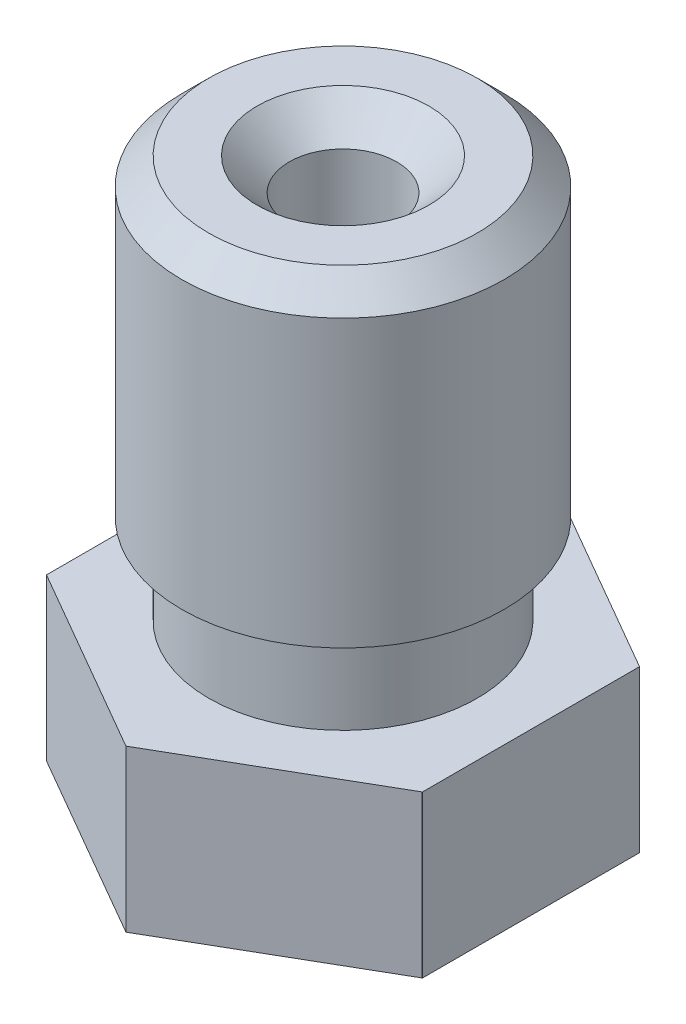
ISO-10303-21;
HEADER;
FILE_DESCRIPTION(('STEP AP214'),'2;1');
FILE_NAME('part.step','',(''),(''),'','','');
FILE_SCHEMA(('AUTOMOTIVE_DESIGN { 1 0 10303 214 1 1 1 1 }'));
ENDSEC;
DATA;
#1=APPLICATION_CONTEXT('core data for automotive mechanical design processes');
#2=APPLICATION_PROTOCOL_DEFINITION('international standard','automotive_design',2000,#1);
#3=PRODUCT_CONTEXT('',#1,'mechanical');
#4=PRODUCT('Part','Part','',(#3));
#5=PRODUCT_RELATED_PRODUCT_CATEGORY('part','',(#4));
#6=PRODUCT_DEFINITION_FORMATION('','',#4);
#7=PRODUCT_DEFINITION_CONTEXT('part definition',#1,'design');
#8=PRODUCT_DEFINITION('design','',#6,#7);
#9=PRODUCT_DEFINITION_SHAPE('','',#8);
#10=(LENGTH_UNIT() NAMED_UNIT(*) SI_UNIT(.MILLI.,.METRE.));
#11=(NAMED_UNIT(*) PLANE_ANGLE_UNIT() SI_UNIT($,.RADIAN.));
#12=(NAMED_UNIT(*) SI_UNIT($,.STERADIAN.) SOLID_ANGLE_UNIT());
#13=UNCERTAINTY_MEASURE_WITH_UNIT(LENGTH_MEASURE(1.E-05),#10,'distance_accuracy_value','');
#14=(GEOMETRIC_REPRESENTATION_CONTEXT(3) GLOBAL_UNCERTAINTY_ASSIGNED_CONTEXT((#13)) GLOBAL_UNIT_ASSIGNED_CONTEXT((#10,
#11,#12)) REPRESENTATION_CONTEXT('',''));
#15=CARTESIAN_POINT('',(0.,0.,0.));
#16=DIRECTION('',(0.,0.,1.));
#17=DIRECTION('',(1.,0.,0.));
#18=AXIS2_PLACEMENT_3D('',#15,#16,#17);
#19=CARTESIAN_POINT('',(0.,2.00000000000001,1.90041507641942));
#20=DIRECTION('',(0.,1.,0.));
#21=DIRECTION('',(0.,0.,1.));
#22=AXIS2_PLACEMENT_3D('',#19,#20,#21);
#23=PLANE('',#22);
#24=CARTESIAN_POINT('',(0.,2.,0.));
#25=DIRECTION('',(0.,-1.,0.));
#26=DIRECTION('',(0.,0.,-1.));
#27=AXIS2_PLACEMENT_3D('',#24,#25,#26);
#28=CIRCLE('',#27,1.90041507641942);
#29=CARTESIAN_POINT('',(0.,2.,-1.90041507641942));
#30=VERTEX_POINT('',#29);
#31=EDGE_CURVE('E168',#30,#30,#28,.T.);
#32=ORIENTED_EDGE('',*,*,#31,.F.);
#33=EDGE_LOOP('',(#32));
#34=FACE_BOUND('',#33,.T.);
#35=DIRECTION('',(-0.866025403784439,0.,-0.5));
#36=VECTOR('',#35,1.);
#37=CARTESIAN_POINT('',(0.,2.00000000000001,4.04145188432738));
#38=LINE('',#37,#36);
#39=CARTESIAN_POINT('',(-0.00251609449471267,2.00000000000001,4.03999921649355));
#40=VERTEX_POINT('',#39);
#41=CARTESIAN_POINT('',(-3.49748390550528,2.00000000000001,2.02217860999752));
#42=VERTEX_POINT('',#41);
#43=EDGE_CURVE('E375',#40,#42,#38,.T.);
#44=ORIENTED_EDGE('',*,*,#43,.T.);
#45=CARTESIAN_POINT('',(0.,2.00000000000001,0.));
#46=DIRECTION('',(0.,-1.,0.));
#47=DIRECTION('',(0.,0.,-1.));
#48=AXIS2_PLACEMENT_3D('',#45,#46,#47);
#49=CIRCLE('',#48,4.04);
#50=CARTESIAN_POINT('',(-3.5,2.00000000000001,2.01782060649603));
#51=VERTEX_POINT('',#50);
#52=EDGE_CURVE('E326',#42,#51,#49,.T.);
#53=ORIENTED_EDGE('',*,*,#52,.T.);
#54=DIRECTION('',(0.,0.,-1.));
#55=VECTOR('',#54,1.);
#56=CARTESIAN_POINT('',(-3.5,2.00000000000001,2.02072594216369));
#57=LINE('',#56,#55);
#58=CARTESIAN_POINT('',(-3.5,2.00000000000001,-2.01782060649603));
#59=VERTEX_POINT('',#58);
#60=EDGE_CURVE('E335',#51,#59,#57,.T.);
#61=ORIENTED_EDGE('',*,*,#60,.T.);
#62=CARTESIAN_POINT('',(-3.49748390550529,2.00000000000001,-2.02217860999752));
#63=VERTEX_POINT('',#62);
#64=EDGE_CURVE('E166',#59,#63,#49,.T.);
#65=ORIENTED_EDGE('',*,*,#64,.T.);
#66=DIRECTION('',(0.866025403784439,0.,-0.5));
#67=VECTOR('',#66,1.);
#68=CARTESIAN_POINT('',(-3.5,2.00000000000001,-2.02072594216369));
#69=LINE('',#68,#67);
#70=CARTESIAN_POINT('',(-0.00251609449471429,2.00000000000001,-4.03999921649355));
#71=VERTEX_POINT('',#70);
#72=EDGE_CURVE('E333',#63,#71,#69,.T.);
#73=ORIENTED_EDGE('',*,*,#72,.T.);
#74=CARTESIAN_POINT('',(0.00251609449471486,2.00000000000001,-4.03999921649355));
#75=VERTEX_POINT('',#74);
#76=EDGE_CURVE('E163',#71,#75,#49,.T.);
#77=ORIENTED_EDGE('',*,*,#76,.T.);
#78=DIRECTION('',(0.866025403784439,0.,0.5));
#79=VECTOR('',#78,1.);
#80=CARTESIAN_POINT('',(0.,2.00000000000001,-4.04145188432738));
#81=LINE('',#80,#79);
#82=CARTESIAN_POINT('',(3.49748390550528,2.00000000000001,-2.02217860999752));
#83=VERTEX_POINT('',#82);
#84=EDGE_CURVE('E324',#75,#83,#81,.T.);
#85=ORIENTED_EDGE('',*,*,#84,.T.);
#86=CARTESIAN_POINT('',(3.5,2.00000000000001,-2.01782060649603));
#87=VERTEX_POINT('',#86);
#88=EDGE_CURVE('E167',#83,#87,#49,.T.);
#89=ORIENTED_EDGE('',*,*,#88,.T.);
#90=DIRECTION('',(0.,0.,1.));
#91=VECTOR('',#90,1.);
#92=CARTESIAN_POINT('',(3.5,2.00000000000001,-2.02072594216369));
#93=LINE('',#92,#91);
#94=CARTESIAN_POINT('',(3.5,2.00000000000001,2.01782060649603));
#95=VERTEX_POINT('',#94);
#96=EDGE_CURVE('E312',#87,#95,#93,.T.);
#97=ORIENTED_EDGE('',*,*,#96,.T.);
#98=CARTESIAN_POINT('',(3.49748390550528,2.00000000000001,2.02217860999752));
#99=VERTEX_POINT('',#98);
#100=EDGE_CURVE('E321',#95,#99,#49,.T.);
#101=ORIENTED_EDGE('',*,*,#100,.T.);
#102=DIRECTION('',(-0.866025403784439,0.,0.5));
#103=VECTOR('',#102,1.);
#104=CARTESIAN_POINT('',(3.5,2.00000000000001,2.02072594216369));
#105=LINE('',#104,#103);
#106=CARTESIAN_POINT('',(0.00251609449471559,2.00000000000001,4.03999921649355));
#107=VERTEX_POINT('',#106);
#108=EDGE_CURVE('E376',#99,#107,#105,.T.);
#109=ORIENTED_EDGE('',*,*,#108,.T.);
#110=EDGE_CURVE('E144',#107,#40,#49,.T.);
#111=ORIENTED_EDGE('',*,*,#110,.T.);
#112=EDGE_LOOP('',(#44,#53,#61,#65,#73,#77,#85,#89,#97,#101,#109,#111));
#113=FACE_BOUND('',#112,.T.);
#114=ADVANCED_FACE('F35',(#34,#113),#23,.F.);
#115=CARTESIAN_POINT('',(0.,0.,0.));
#116=DIRECTION('',(0.,-1.,0.));
#117=DIRECTION('',(0.,0.,-1.));
#118=AXIS2_PLACEMENT_3D('',#115,#116,#117);
#119=CYLINDRICAL_SURFACE('',#118,4.04);
#120=DIRECTION('',(0.,-1.,0.));
#121=VECTOR('',#120,1.);
#122=CARTESIAN_POINT('',(-3.49748390550529,0.,2.02217860999752));
#123=LINE('',#122,#121);
#124=CARTESIAN_POINT('',(-3.49748390550529,5.,2.02217860999752));
#125=VERTEX_POINT('',#124);
#126=EDGE_CURVE('E353',#125,#42,#123,.T.);
#127=ORIENTED_EDGE('',*,*,#126,.F.);
#128=CARTESIAN_POINT('',(0.,5.,0.));
#129=DIRECTION('',(0.,-1.,0.));
#130=DIRECTION('',(0.,0.,-1.));
#131=AXIS2_PLACEMENT_3D('',#128,#129,#130);
#132=CIRCLE('',#131,4.04);
#133=CARTESIAN_POINT('',(-3.5,5.,2.01782060649603));
#134=VERTEX_POINT('',#133);
#135=EDGE_CURVE('E152',#125,#134,#132,.T.);
#136=ORIENTED_EDGE('',*,*,#135,.T.);
#137=DIRECTION('',(0.,-1.,0.));
#138=VECTOR('',#137,1.);
#139=CARTESIAN_POINT('',(-3.5,0.,2.01782060649603));
#140=LINE('',#139,#138);
#141=EDGE_CURVE('E58',#51,#134,#140,.F.);
#142=ORIENTED_EDGE('',*,*,#141,.F.);
#143=ORIENTED_EDGE('',*,*,#52,.F.);
#144=EDGE_LOOP('',(#127,#136,#142,#143));
#145=FACE_BOUND('',#144,.T.);
#146=ADVANCED_FACE('F212',(#145),#119,.T.);
#147=DIRECTION('',(0.,-1.,0.));
#148=VECTOR('',#147,1.);
#149=CARTESIAN_POINT('',(-0.00251609449471212,0.,4.03999921649355));
#150=LINE('',#149,#148);
#151=CARTESIAN_POINT('',(-0.00251609449471537,5.,4.03999921649355));
#152=VERTEX_POINT('',#151);
#153=EDGE_CURVE('E351',#40,#152,#150,.F.);
#154=ORIENTED_EDGE('',*,*,#153,.F.);
#155=ORIENTED_EDGE('',*,*,#110,.F.);
#156=DIRECTION('',(0.,-1.,0.));
#157=VECTOR('',#156,1.);
#158=CARTESIAN_POINT('',(0.00251609449471515,0.,4.03999921649355));
#159=LINE('',#158,#157);
#160=CARTESIAN_POINT('',(0.00251473742173339,5.,4.04));
#161=VERTEX_POINT('',#160);
#162=EDGE_CURVE('E126',#161,#107,#159,.T.);
#163=ORIENTED_EDGE('',*,*,#162,.F.);
#164=EDGE_CURVE('E142',#161,#152,#132,.T.);
#165=ORIENTED_EDGE('',*,*,#164,.T.);
#166=EDGE_LOOP('',(#154,#155,#163,#165));
#167=FACE_BOUND('',#166,.T.);
#168=ADVANCED_FACE('F141',(#167),#119,.T.);
#169=DIRECTION('',(0.,-1.,0.));
#170=VECTOR('',#169,1.);
#171=CARTESIAN_POINT('',(-3.5,0.,-2.01782060649603));
#172=LINE('',#171,#170);
#173=CARTESIAN_POINT('',(-3.5,5.,-2.01782060649603));
#174=VERTEX_POINT('',#173);
#175=EDGE_CURVE('E340',#174,#59,#172,.T.);
#176=ORIENTED_EDGE('',*,*,#175,.F.);
#177=CARTESIAN_POINT('',(-3.49748390550529,5.,-2.02217860999752));
#178=VERTEX_POINT('',#177);
#179=EDGE_CURVE('E156',#174,#178,#132,.T.);
#180=ORIENTED_EDGE('',*,*,#179,.T.);
#181=DIRECTION('',(0.,-1.,0.));
#182=VECTOR('',#181,1.);
#183=CARTESIAN_POINT('',(-3.49748390550529,0.,-2.02217860999752));
#184=LINE('',#183,#182);
#185=EDGE_CURVE('E50',#63,#178,#184,.F.);
#186=ORIENTED_EDGE('',*,*,#185,.F.);
#187=ORIENTED_EDGE('',*,*,#64,.F.);
#188=EDGE_LOOP('',(#176,#180,#186,#187));
#189=FACE_BOUND('',#188,.T.);
#190=ADVANCED_FACE('F338',(#189),#119,.T.);
#191=DIRECTION('',(0.,-1.,0.));
#192=VECTOR('',#191,1.);
#193=CARTESIAN_POINT('',(-0.0025160944947132,0.,-4.03999921649355));
#194=LINE('',#193,#192);
#195=CARTESIAN_POINT('',(-0.00251473742173165,5.,-4.04));
#196=VERTEX_POINT('',#195);
#197=EDGE_CURVE('E342',#196,#71,#194,.T.);
#198=ORIENTED_EDGE('',*,*,#197,.F.);
#199=CARTESIAN_POINT('',(0.00251609449471234,5.,-4.03999921649355));
#200=VERTEX_POINT('',#199);
#201=EDGE_CURVE('E157',#196,#200,#132,.T.);
#202=ORIENTED_EDGE('',*,*,#201,.T.);
#203=DIRECTION('',(0.,-1.,0.));
#204=VECTOR('',#203,1.);
#205=CARTESIAN_POINT('',(0.00251609449471515,0.,-4.03999921649355));
#206=LINE('',#205,#204);
#207=EDGE_CURVE('E316',#75,#200,#206,.F.);
#208=ORIENTED_EDGE('',*,*,#207,.F.);
#209=ORIENTED_EDGE('',*,*,#76,.F.);
#210=EDGE_LOOP('',(#198,#202,#208,#209));
#211=FACE_BOUND('',#210,.T.);
#212=ADVANCED_FACE('F392',(#211),#119,.T.);
#213=DIRECTION('',(0.,-1.,0.));
#214=VECTOR('',#213,1.);
#215=CARTESIAN_POINT('',(3.49748390550528,0.,-2.02217860999752));
#216=LINE('',#215,#214);
#217=CARTESIAN_POINT('',(3.49748390550529,5.,-2.02217860999752));
#218=VERTEX_POINT('',#217);
#219=EDGE_CURVE('E343',#218,#83,#216,.T.);
#220=ORIENTED_EDGE('',*,*,#219,.F.);
#221=CARTESIAN_POINT('',(3.5,5.,-2.01782060649603));
#222=VERTEX_POINT('',#221);
#223=EDGE_CURVE('E154',#218,#222,#132,.T.);
#224=ORIENTED_EDGE('',*,*,#223,.T.);
#225=DIRECTION('',(0.,-1.,0.));
#226=VECTOR('',#225,1.);
#227=CARTESIAN_POINT('',(3.5,0.,-2.01782060649603));
#228=LINE('',#227,#226);
#229=EDGE_CURVE('E145',#87,#222,#228,.F.);
#230=ORIENTED_EDGE('',*,*,#229,.F.);
#231=ORIENTED_EDGE('',*,*,#88,.F.);
#232=EDGE_LOOP('',(#220,#224,#230,#231));
#233=FACE_BOUND('',#232,.T.);
#234=ADVANCED_FACE('F272',(#233),#119,.T.);
#235=DIRECTION('',(0.,-1.,0.));
#236=VECTOR('',#235,1.);
#237=CARTESIAN_POINT('',(3.5,0.,2.01782060649603));
#238=LINE('',#237,#236);
#239=CARTESIAN_POINT('',(3.5,5.,2.01782060649603));
#240=VERTEX_POINT('',#239);
#241=EDGE_CURVE('E310',#240,#95,#238,.T.);
#242=ORIENTED_EDGE('',*,*,#241,.F.);
#243=CARTESIAN_POINT('',(3.49748390550528,5.,2.02217860999752));
#244=VERTEX_POINT('',#243);
#245=EDGE_CURVE('E151',#240,#244,#132,.T.);
#246=ORIENTED_EDGE('',*,*,#245,.T.);
#247=DIRECTION('',(0.,-1.,0.));
#248=VECTOR('',#247,1.);
#249=CARTESIAN_POINT('',(3.49748390550528,0.,2.02217860999752));
#250=LINE('',#249,#248);
#251=EDGE_CURVE('E129',#99,#244,#250,.F.);
#252=ORIENTED_EDGE('',*,*,#251,.F.);
#253=ORIENTED_EDGE('',*,*,#100,.F.);
#254=EDGE_LOOP('',(#242,#246,#252,#253));
#255=FACE_BOUND('',#254,.T.);
#256=ADVANCED_FACE('F220',(#255),#119,.T.);
#257=CARTESIAN_POINT('',(0.,5.,4.04));
#258=DIRECTION('',(0.,-1.,0.));
#259=DIRECTION('',(0.,0.,-1.));
#260=AXIS2_PLACEMENT_3D('',#257,#258,#259);
#261=PLANE('',#260);
#262=CARTESIAN_POINT('',(0.,5.,0.));
#263=DIRECTION('',(0.,-1.,0.));
#264=DIRECTION('',(0.,0.,-1.));
#265=AXIS2_PLACEMENT_3D('',#262,#263,#264);
#266=CIRCLE('',#265,2.5);
#267=CARTESIAN_POINT('',(0.,5.,-2.5));
#268=VERTEX_POINT('',#267);
#269=EDGE_CURVE('E161',#268,#268,#266,.T.);
#270=ORIENTED_EDGE('',*,*,#269,.T.);
#271=EDGE_LOOP('',(#270));
#272=FACE_BOUND('',#271,.T.);
#273=DIRECTION('',(-0.866025403784439,0.,-0.5));
#274=VECTOR('',#273,1.);
#275=CARTESIAN_POINT('',(-0.00062868435543342,5.,4.04108891324553));
#276=LINE('',#275,#274);
#277=EDGE_CURVE('E150',#152,#125,#276,.T.);
#278=ORIENTED_EDGE('',*,*,#277,.F.);
#279=ORIENTED_EDGE('',*,*,#164,.F.);
#280=DIRECTION('',(-0.866025403784439,0.,0.5));
#281=VECTOR('',#280,1.);
#282=CARTESIAN_POINT('',(0.000628684355433455,5.,4.04108891324553));
#283=LINE('',#282,#281);
#284=EDGE_CURVE('E123',#244,#161,#283,.T.);
#285=ORIENTED_EDGE('',*,*,#284,.F.);
#286=ORIENTED_EDGE('',*,*,#245,.F.);
#287=DIRECTION('',(0.,0.,1.));
#288=VECTOR('',#287,1.);
#289=CARTESIAN_POINT('',(3.5,5.,4.04));
#290=LINE('',#289,#288);
#291=EDGE_CURVE('E134',#222,#240,#290,.T.);
#292=ORIENTED_EDGE('',*,*,#291,.F.);
#293=ORIENTED_EDGE('',*,*,#223,.F.);
#294=DIRECTION('',(0.866025403784439,0.,0.5));
#295=VECTOR('',#294,1.);
#296=CARTESIAN_POINT('',(3.49937131564456,5.,-2.02108891324553));
#297=LINE('',#296,#295);
#298=EDGE_CURVE('E189',#200,#218,#297,.T.);
#299=ORIENTED_EDGE('',*,*,#298,.F.);
#300=ORIENTED_EDGE('',*,*,#201,.F.);
#301=DIRECTION('',(0.866025403784439,0.,-0.5));
#302=VECTOR('',#301,1.);
#303=CARTESIAN_POINT('',(-3.49937131564457,5.,-2.02108891324553));
#304=LINE('',#303,#302);
#305=EDGE_CURVE('E191',#178,#196,#304,.T.);
#306=ORIENTED_EDGE('',*,*,#305,.F.);
#307=ORIENTED_EDGE('',*,*,#179,.F.);
#308=DIRECTION('',(0.,0.,-1.));
#309=VECTOR('',#308,1.);
#310=CARTESIAN_POINT('',(-3.5,5.,4.04));
#311=LINE('',#310,#309);
#312=EDGE_CURVE('E193',#134,#174,#311,.T.);
#313=ORIENTED_EDGE('',*,*,#312,.F.);
#314=ORIENTED_EDGE('',*,*,#135,.F.);
#315=EDGE_LOOP('',(#278,#279,#285,#286,#292,#293,#299,#300,#306,#307,#313,#314));
#316=FACE_BOUND('',#315,.T.);
#317=ADVANCED_FACE('F148',(#272,#316),#261,.F.);
#318=CARTESIAN_POINT('',(0.,0.,0.));
#319=DIRECTION('',(0.,-1.,0.));
#320=DIRECTION('',(0.,0.,-1.));
#321=AXIS2_PLACEMENT_3D('',#318,#319,#320);
#322=CYLINDRICAL_SURFACE('',#321,1.);
#323=CARTESIAN_POINT('',(0.,11.9,0.));
#324=DIRECTION('',(0.,-1.,0.));
#325=DIRECTION('',(0.,0.,-1.));
#326=AXIS2_PLACEMENT_3D('',#323,#324,#325);
#327=CIRCLE('',#326,1.);
#328=CARTESIAN_POINT('',(0.,11.9,-1.));
#329=VERTEX_POINT('',#328);
#330=EDGE_CURVE('E12',#329,#329,#327,.F.);
#331=ORIENTED_EDGE('',*,*,#330,.T.);
#332=EDGE_LOOP('',(#331));
#333=FACE_BOUND('',#332,.T.);
#334=CARTESIAN_POINT('',(0.,2.,0.));
#335=DIRECTION('',(0.,-1.,0.));
#336=DIRECTION('',(0.,0.,-1.));
#337=AXIS2_PLACEMENT_3D('',#334,#335,#336);
#338=CIRCLE('',#337,1.);
#339=CARTESIAN_POINT('',(0.,2.,-1.));
#340=VERTEX_POINT('',#339);
#341=EDGE_CURVE('E135',#340,#340,#338,.T.);
#342=ORIENTED_EDGE('',*,*,#341,.T.);
#343=EDGE_LOOP('',(#342));
#344=FACE_BOUND('',#343,.T.);
#345=ADVANCED_FACE('F248',(#333,#344),#322,.F.);
#346=CARTESIAN_POINT('',(0.,1.84978484524311,0.));
#347=DIRECTION('',(0.,1.,0.));
#348=DIRECTION('',(0.,0.,1.));
#349=AXIS2_PLACEMENT_3D('',#346,#347,#348);
#350=CONICAL_SURFACE('',#349,0.75,1.02974425867665);
#351=ORIENTED_EDGE('',*,*,#341,.F.);
#352=EDGE_LOOP('',(#351));
#353=FACE_BOUND('',#352,.T.);
#354=CARTESIAN_POINT('',(0.,1.84978484524311,0.));
#355=DIRECTION('',(0.,-1.,0.));
#356=DIRECTION('',(0.,0.,-1.));
#357=AXIS2_PLACEMENT_3D('',#354,#355,#356);
#358=CIRCLE('',#357,0.75);
#359=CARTESIAN_POINT('',(0.,1.84978484524311,-0.75));
#360=VERTEX_POINT('',#359);
#361=EDGE_CURVE('E183',#360,#360,#358,.T.);
#362=ORIENTED_EDGE('',*,*,#361,.T.);
#363=EDGE_LOOP('',(#362));
#364=FACE_BOUND('',#363,.T.);
#365=ADVANCED_FACE('F245',(#353,#364),#350,.F.);
#366=CARTESIAN_POINT('',(0.,0.,0.));
#367=DIRECTION('',(0.,-1.,0.));
#368=DIRECTION('',(0.,0.,-1.));
#369=AXIS2_PLACEMENT_3D('',#366,#367,#368);
#370=CYLINDRICAL_SURFACE('',#369,0.75);
#371=ORIENTED_EDGE('',*,*,#361,.F.);
#372=EDGE_LOOP('',(#371));
#373=FACE_BOUND('',#372,.T.);
#374=CARTESIAN_POINT('',(0.,1.01030121665965,0.));
#375=DIRECTION('',(0.,-1.,0.));
#376=DIRECTION('',(0.,0.,-1.));
#377=AXIS2_PLACEMENT_3D('',#374,#375,#376);
#378=CIRCLE('',#377,0.75);
#379=CARTESIAN_POINT('',(0.,1.01030121665965,-0.75));
#380=VERTEX_POINT('',#379);
#381=EDGE_CURVE('E180',#380,#380,#378,.T.);
#382=ORIENTED_EDGE('',*,*,#381,.T.);
#383=EDGE_LOOP('',(#382));
#384=FACE_BOUND('',#383,.T.);
#385=ADVANCED_FACE('F241',(#373,#384),#370,.F.);
#386=CARTESIAN_POINT('',(0.,0.8,0.));
#387=DIRECTION('',(0.,1.,0.));
#388=DIRECTION('',(0.,0.,1.));
#389=AXIS2_PLACEMENT_3D('',#386,#387,#388);
#390=CONICAL_SURFACE('',#389,0.4,1.02974425867665);
#391=ORIENTED_EDGE('',*,*,#381,.F.);
#392=EDGE_LOOP('',(#391));
#393=FACE_BOUND('',#392,.T.);
#394=CARTESIAN_POINT('',(0.,0.8,0.));
#395=DIRECTION('',(0.,-1.,0.));
#396=DIRECTION('',(0.,0.,-1.));
#397=AXIS2_PLACEMENT_3D('',#394,#395,#396);
#398=CIRCLE('',#397,0.4);
#399=CARTESIAN_POINT('',(0.,0.8,-0.4));
#400=VERTEX_POINT('',#399);
#401=EDGE_CURVE('E177',#400,#400,#398,.T.);
#402=ORIENTED_EDGE('',*,*,#401,.T.);
#403=EDGE_LOOP('',(#402));
#404=FACE_BOUND('',#403,.T.);
#405=ADVANCED_FACE('F237',(#393,#404),#390,.F.);
#406=CARTESIAN_POINT('',(0.,0.,0.));
#407=DIRECTION('',(0.,-1.,0.));
#408=DIRECTION('',(0.,0.,-1.));
#409=AXIS2_PLACEMENT_3D('',#406,#407,#408);
#410=CYLINDRICAL_SURFACE('',#409,0.399999999999999);
#411=ORIENTED_EDGE('',*,*,#401,.F.);
#412=EDGE_LOOP('',(#411));
#413=FACE_BOUND('',#412,.T.);
#414=CARTESIAN_POINT('',(0.,0.,0.));
#415=DIRECTION('',(0.,-1.,0.));
#416=DIRECTION('',(0.,0.,-1.));
#417=AXIS2_PLACEMENT_3D('',#414,#415,#416);
#418=CIRCLE('',#417,0.399999999999998);
#419=CARTESIAN_POINT('',(0.,0.,-0.399999999999998));
#420=VERTEX_POINT('',#419);
#421=EDGE_CURVE('E174',#420,#420,#418,.T.);
#422=ORIENTED_EDGE('',*,*,#421,.T.);
#423=EDGE_LOOP('',(#422));
#424=FACE_BOUND('',#423,.T.);
#425=ADVANCED_FACE('F233',(#413,#424),#410,.F.);
#426=CARTESIAN_POINT('',(0.,0.,0.399999999999998));
#427=DIRECTION('',(0.,1.,0.));
#428=DIRECTION('',(0.,0.,1.));
#429=AXIS2_PLACEMENT_3D('',#426,#427,#428);
#430=PLANE('',#429);
#431=ORIENTED_EDGE('',*,*,#421,.F.);
#432=EDGE_LOOP('',(#431));
#433=FACE_BOUND('',#432,.T.);
#434=CARTESIAN_POINT('',(0.,0.,0.));
#435=DIRECTION('',(0.,-1.,0.));
#436=DIRECTION('',(0.,0.,-1.));
#437=AXIS2_PLACEMENT_3D('',#434,#435,#436);
#438=CIRCLE('',#437,0.5);
#439=CARTESIAN_POINT('',(0.,0.,-0.5));
#440=VERTEX_POINT('',#439);
#441=EDGE_CURVE('E171',#440,#440,#438,.T.);
#442=ORIENTED_EDGE('',*,*,#441,.T.);
#443=EDGE_LOOP('',(#442));
#444=FACE_BOUND('',#443,.T.);
#445=ADVANCED_FACE('F229',(#433,#444),#430,.F.);
#446=CARTESIAN_POINT('',(0.,2.,0.));
#447=DIRECTION('',(0.,1.,0.));
#448=DIRECTION('',(0.,0.,1.));
#449=AXIS2_PLACEMENT_3D('',#446,#447,#448);
#450=CONICAL_SURFACE('',#449,1.90041507641942,0.610865238198013);
#451=ORIENTED_EDGE('',*,*,#441,.F.);
#452=EDGE_LOOP('',(#451));
#453=FACE_BOUND('',#452,.T.);
#454=ORIENTED_EDGE('',*,*,#31,.T.);
#455=EDGE_LOOP('',(#454));
#456=FACE_BOUND('',#455,.T.);
#457=ADVANCED_FACE('F225',(#453,#456),#450,.T.);
#458=CARTESIAN_POINT('',(0.,0.,0.));
#459=DIRECTION('',(0.,-1.,0.));
#460=DIRECTION('',(0.,0.,-1.));
#461=AXIS2_PLACEMENT_3D('',#458,#459,#460);
#462=CYLINDRICAL_SURFACE('',#461,2.5);
#463=ORIENTED_EDGE('',*,*,#269,.F.);
#464=EDGE_LOOP('',(#463));
#465=FACE_BOUND('',#464,.T.);
#466=CARTESIAN_POINT('',(0.,6.5,0.));
#467=DIRECTION('',(0.,-1.,0.));
#468=DIRECTION('',(0.,0.,-1.));
#469=AXIS2_PLACEMENT_3D('',#466,#467,#468);
#470=CIRCLE('',#469,2.5);
#471=CARTESIAN_POINT('',(0.,6.5,-2.5));
#472=VERTEX_POINT('',#471);
#473=EDGE_CURVE('E363',#472,#472,#470,.T.);
#474=ORIENTED_EDGE('',*,*,#473,.T.);
#475=EDGE_LOOP('',(#474));
#476=FACE_BOUND('',#475,.T.);
#477=ADVANCED_FACE('F228',(#465,#476),#462,.T.);
#478=CARTESIAN_POINT('',(0.,6.6819851171331,0.));
#479=DIRECTION('',(0.,1.,0.));
#480=DIRECTION('',(0.,0.,1.));
#481=AXIS2_PLACEMENT_3D('',#478,#479,#480);
#482=CONICAL_SURFACE('',#481,3.,1.22173047639603);
#483=ORIENTED_EDGE('',*,*,#473,.F.);
#484=EDGE_LOOP('',(#483));
#485=FACE_BOUND('',#484,.T.);
#486=CARTESIAN_POINT('',(0.,6.6819851171331,0.));
#487=DIRECTION('',(0.,-1.,0.));
#488=DIRECTION('',(0.,0.,-1.));
#489=AXIS2_PLACEMENT_3D('',#486,#487,#488);
#490=CIRCLE('',#489,3.);
#491=CARTESIAN_POINT('',(0.,6.6819851171331,-3.));
#492=VERTEX_POINT('',#491);
#493=EDGE_CURVE('E361',#492,#492,#490,.T.);
#494=ORIENTED_EDGE('',*,*,#493,.T.);
#495=EDGE_LOOP('',(#494));
#496=FACE_BOUND('',#495,.T.);
#497=ADVANCED_FACE('F278',(#485,#496),#482,.T.);
#498=CARTESIAN_POINT('',(0.,0.,0.));
#499=DIRECTION('',(0.,-1.,0.));
#500=DIRECTION('',(0.,0.,-1.));
#501=AXIS2_PLACEMENT_3D('',#498,#499,#500);
#502=CYLINDRICAL_SURFACE('',#501,3.);
#503=ORIENTED_EDGE('',*,*,#493,.F.);
#504=EDGE_LOOP('',(#503));
#505=FACE_BOUND('',#504,.T.);
#506=CARTESIAN_POINT('',(0.,12.,0.));
#507=DIRECTION('',(0.,-1.,0.));
#508=DIRECTION('',(0.,0.,-1.));
#509=AXIS2_PLACEMENT_3D('',#506,#507,#508);
#510=CIRCLE('',#509,3.);
#511=CARTESIAN_POINT('',(0.,12.,-3.));
#512=VERTEX_POINT('',#511);
#513=EDGE_CURVE('E358',#512,#512,#510,.T.);
#514=ORIENTED_EDGE('',*,*,#513,.T.);
#515=EDGE_LOOP('',(#514));
#516=FACE_BOUND('',#515,.T.);
#517=ADVANCED_FACE('F282',(#505,#516),#502,.T.);
#518=CARTESIAN_POINT('',(0.,12.5,0.));
#519=DIRECTION('',(0.,-1.,0.));
#520=DIRECTION('',(0.,0.,-1.));
#521=AXIS2_PLACEMENT_3D('',#518,#519,#520);
#522=CONICAL_SURFACE('',#521,2.5,0.785398163397451);
#523=ORIENTED_EDGE('',*,*,#513,.F.);
#524=EDGE_LOOP('',(#523));
#525=FACE_BOUND('',#524,.T.);
#526=CARTESIAN_POINT('',(0.,12.5,0.));
#527=DIRECTION('',(0.,-1.,0.));
#528=DIRECTION('',(0.,0.,-1.));
#529=AXIS2_PLACEMENT_3D('',#526,#527,#528);
#530=CIRCLE('',#529,2.5);
#531=CARTESIAN_POINT('',(0.,12.5,-2.5));
#532=VERTEX_POINT('',#531);
#533=EDGE_CURVE('E355',#532,#532,#530,.T.);
#534=ORIENTED_EDGE('',*,*,#533,.T.);
#535=EDGE_LOOP('',(#534));
#536=FACE_BOUND('',#535,.T.);
#537=ADVANCED_FACE('F286',(#525,#536),#522,.T.);
#538=CARTESIAN_POINT('',(0.,12.5,2.5));
#539=DIRECTION('',(0.,-1.,0.));
#540=DIRECTION('',(0.,0.,-1.));
#541=AXIS2_PLACEMENT_3D('',#538,#539,#540);
#542=PLANE('',#541);
#543=CARTESIAN_POINT('',(0.,12.5,0.));
#544=DIRECTION('',(0.,-1.,0.));
#545=DIRECTION('',(0.,0.,-1.));
#546=AXIS2_PLACEMENT_3D('',#543,#544,#545);
#547=CIRCLE('',#546,1.6);
#548=CARTESIAN_POINT('',(0.,12.5,-1.6));
#549=VERTEX_POINT('',#548);
#550=EDGE_CURVE('E43',#549,#549,#547,.T.);
#551=ORIENTED_EDGE('',*,*,#550,.T.);
#552=EDGE_LOOP('',(#551));
#553=FACE_BOUND('',#552,.T.);
#554=ORIENTED_EDGE('',*,*,#533,.F.);
#555=EDGE_LOOP('',(#554));
#556=FACE_BOUND('',#555,.T.);
#557=ADVANCED_FACE('F198',(#553,#556),#542,.F.);
#558=CARTESIAN_POINT('',(3.5,17.088709369719,2.02072594216369));
#559=DIRECTION('',(0.5,0.,0.866025403784439));
#560=DIRECTION('',(0.866025403784439,0.,-0.5));
#561=AXIS2_PLACEMENT_3D('',#558,#559,#560);
#562=PLANE('',#561);
#563=ORIENTED_EDGE('',*,*,#162,.T.);
#564=ORIENTED_EDGE('',*,*,#108,.F.);
#565=ORIENTED_EDGE('',*,*,#251,.T.);
#566=ORIENTED_EDGE('',*,*,#284,.T.);
#567=EDGE_LOOP('',(#563,#564,#565,#566));
#568=FACE_BOUND('',#567,.T.);
#569=ADVANCED_FACE('F125',(#568),#562,.T.);
#570=CARTESIAN_POINT('',(3.5,17.088709369719,-2.02072594216369));
#571=DIRECTION('',(1.,0.,0.));
#572=DIRECTION('',(0.,0.,-1.));
#573=AXIS2_PLACEMENT_3D('',#570,#571,#572);
#574=PLANE('',#573);
#575=ORIENTED_EDGE('',*,*,#241,.T.);
#576=ORIENTED_EDGE('',*,*,#96,.F.);
#577=ORIENTED_EDGE('',*,*,#229,.T.);
#578=ORIENTED_EDGE('',*,*,#291,.T.);
#579=EDGE_LOOP('',(#575,#576,#577,#578));
#580=FACE_BOUND('',#579,.T.);
#581=ADVANCED_FACE('F294',(#580),#574,.T.);
#582=CARTESIAN_POINT('',(0.,17.088709369719,-4.04145188432738));
#583=DIRECTION('',(0.5,0.,-0.866025403784439));
#584=DIRECTION('',(-0.866025403784439,0.,-0.5));
#585=AXIS2_PLACEMENT_3D('',#582,#583,#584);
#586=PLANE('',#585);
#587=ORIENTED_EDGE('',*,*,#219,.T.);
#588=ORIENTED_EDGE('',*,*,#84,.F.);
#589=ORIENTED_EDGE('',*,*,#207,.T.);
#590=ORIENTED_EDGE('',*,*,#298,.T.);
#591=EDGE_LOOP('',(#587,#588,#589,#590));
#592=FACE_BOUND('',#591,.T.);
#593=ADVANCED_FACE('F301',(#592),#586,.T.);
#594=CARTESIAN_POINT('',(-3.5,17.088709369719,-2.02072594216369));
#595=DIRECTION('',(-0.5,0.,-0.866025403784439));
#596=DIRECTION('',(-0.866025403784439,0.,0.5));
#597=AXIS2_PLACEMENT_3D('',#594,#595,#596);
#598=PLANE('',#597);
#599=ORIENTED_EDGE('',*,*,#197,.T.);
#600=ORIENTED_EDGE('',*,*,#72,.F.);
#601=ORIENTED_EDGE('',*,*,#185,.T.);
#602=ORIENTED_EDGE('',*,*,#305,.T.);
#603=EDGE_LOOP('',(#599,#600,#601,#602));
#604=FACE_BOUND('',#603,.T.);
#605=ADVANCED_FACE('F298',(#604),#598,.T.);
#606=CARTESIAN_POINT('',(-3.5,17.088709369719,2.02072594216369));
#607=DIRECTION('',(-1.,0.,0.));
#608=DIRECTION('',(0.,0.,1.));
#609=AXIS2_PLACEMENT_3D('',#606,#607,#608);
#610=PLANE('',#609);
#611=ORIENTED_EDGE('',*,*,#175,.T.);
#612=ORIENTED_EDGE('',*,*,#60,.F.);
#613=ORIENTED_EDGE('',*,*,#141,.T.);
#614=ORIENTED_EDGE('',*,*,#312,.T.);
#615=EDGE_LOOP('',(#611,#612,#613,#614));
#616=FACE_BOUND('',#615,.T.);
#617=ADVANCED_FACE('F207',(#616),#610,.T.);
#618=CARTESIAN_POINT('',(0.,17.088709369719,4.04145188432738));
#619=DIRECTION('',(-0.5,0.,0.866025403784439));
#620=DIRECTION('',(0.866025403784439,0.,0.5));
#621=AXIS2_PLACEMENT_3D('',#618,#619,#620);
#622=PLANE('',#621);
#623=ORIENTED_EDGE('',*,*,#126,.T.);
#624=ORIENTED_EDGE('',*,*,#43,.F.);
#625=ORIENTED_EDGE('',*,*,#153,.T.);
#626=ORIENTED_EDGE('',*,*,#277,.T.);
#627=EDGE_LOOP('',(#623,#624,#625,#626));
#628=FACE_BOUND('',#627,.T.);
#629=ADVANCED_FACE('F202',(#628),#622,.T.);
#630=CARTESIAN_POINT('',(0.,12.5,0.));
#631=DIRECTION('',(0.,1.,0.));
#632=DIRECTION('',(0.,0.,1.));
#633=AXIS2_PLACEMENT_3D('',#630,#631,#632);
#634=CONICAL_SURFACE('',#633,1.6,0.785398163397448);
#635=ORIENTED_EDGE('',*,*,#330,.F.);
#636=EDGE_LOOP('',(#635));
#637=FACE_BOUND('',#636,.T.);
#638=ORIENTED_EDGE('',*,*,#550,.F.);
#639=EDGE_LOOP('',(#638));
#640=FACE_BOUND('',#639,.T.);
#641=ADVANCED_FACE('F37',(#637,#640),#634,.F.);
#642=CLOSED_SHELL('',(#114,#146,#168,#190,#212,#234,#256,#317,#345,#365,#385,#405,#425,#445,
#457,#477,#497,#517,#537,#557,#569,#581,#593,#605,#617,#629,#641));
#643=MANIFOLD_SOLID_BREP('B2',#642);
#644=ADVANCED_BREP_SHAPE_REPRESENTATION('',(#18,#643),#14);
#645=SHAPE_DEFINITION_REPRESENTATION(#9,#644);
ENDSEC;
END-ISO-10303-21;
